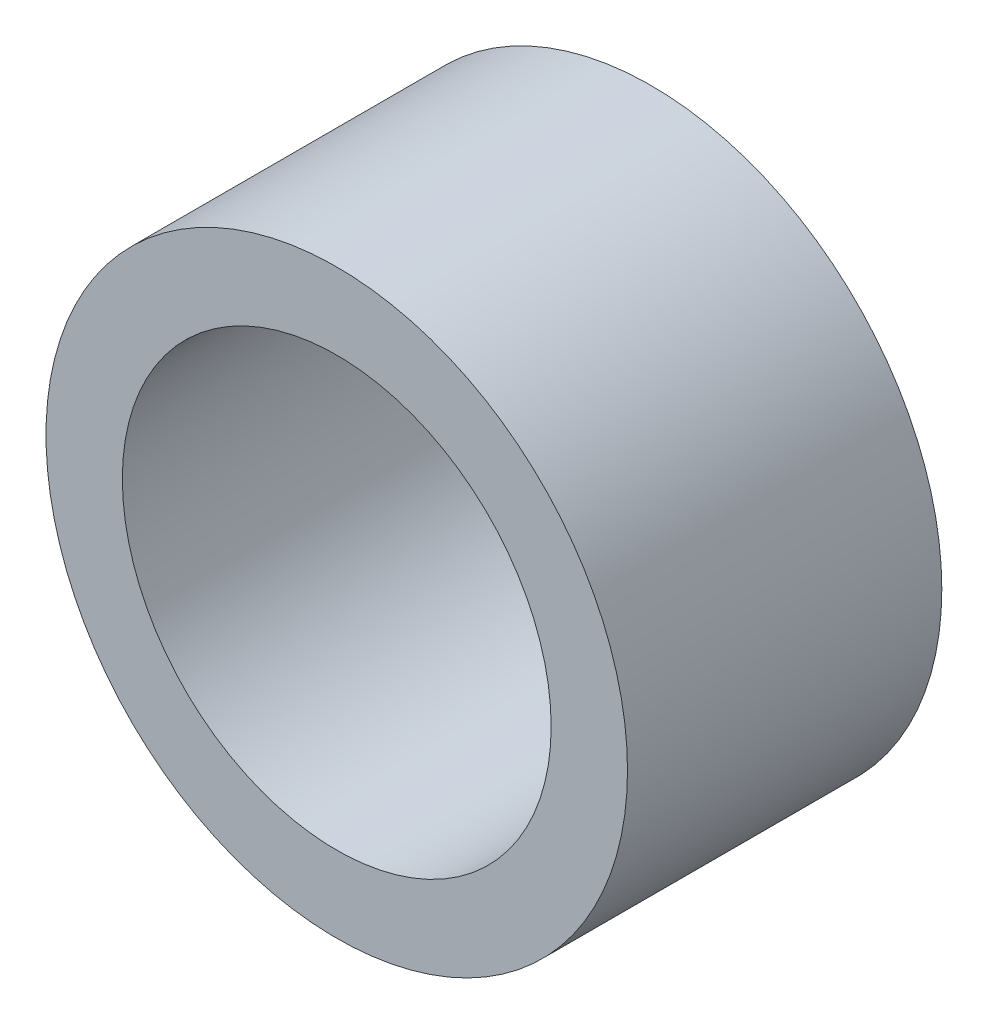
ISO-10303-21;
HEADER;
FILE_DESCRIPTION(('STEP AP214'),'2;1');
FILE_NAME('part.step','',(''),(''),'','','');
FILE_SCHEMA(('AUTOMOTIVE_DESIGN { 1 0 10303 214 1 1 1 1 }'));
ENDSEC;
DATA;
#1=APPLICATION_CONTEXT('core data for automotive mechanical design processes');
#2=APPLICATION_PROTOCOL_DEFINITION('international standard','automotive_design',2000,#1);
#3=PRODUCT_CONTEXT('',#1,'mechanical');
#4=PRODUCT('Part','Part','',(#3));
#5=PRODUCT_RELATED_PRODUCT_CATEGORY('part','',(#4));
#6=PRODUCT_DEFINITION_FORMATION('','',#4);
#7=PRODUCT_DEFINITION_CONTEXT('part definition',#1,'design');
#8=PRODUCT_DEFINITION('design','',#6,#7);
#9=PRODUCT_DEFINITION_SHAPE('','',#8);
#10=(LENGTH_UNIT() NAMED_UNIT(*) SI_UNIT(.MILLI.,.METRE.));
#11=(NAMED_UNIT(*) PLANE_ANGLE_UNIT() SI_UNIT($,.RADIAN.));
#12=(NAMED_UNIT(*) SI_UNIT($,.STERADIAN.) SOLID_ANGLE_UNIT());
#13=UNCERTAINTY_MEASURE_WITH_UNIT(LENGTH_MEASURE(1.E-05),#10,'distance_accuracy_value','');
#14=(GEOMETRIC_REPRESENTATION_CONTEXT(3) GLOBAL_UNCERTAINTY_ASSIGNED_CONTEXT((#13)) GLOBAL_UNIT_ASSIGNED_CONTEXT((#10,
#11,#12)) REPRESENTATION_CONTEXT('',''));
#15=CARTESIAN_POINT('',(0.,0.,0.));
#16=DIRECTION('',(0.,0.,1.));
#17=DIRECTION('',(1.,0.,0.));
#18=AXIS2_PLACEMENT_3D('',#15,#16,#17);
#19=CARTESIAN_POINT('',(0.,0.,7.112));
#20=DIRECTION('',(0.,0.,1.));
#21=DIRECTION('',(1.,0.,0.));
#22=AXIS2_PLACEMENT_3D('',#19,#20,#21);
#23=PLANE('',#22);
#24=CARTESIAN_POINT('',(0.,0.,7.112));
#25=DIRECTION('',(0.,0.,1.));
#26=DIRECTION('',(1.,0.,0.));
#27=AXIS2_PLACEMENT_3D('',#24,#25,#26);
#28=CIRCLE('',#27,6.5786);
#29=CARTESIAN_POINT('',(6.5786,0.,7.112));
#30=VERTEX_POINT('',#29);
#31=EDGE_CURVE('E10',#30,#30,#28,.T.);
#32=ORIENTED_EDGE('',*,*,#31,.T.);
#33=EDGE_LOOP('',(#32));
#34=FACE_BOUND('',#33,.T.);
#35=CARTESIAN_POINT('',(0.,0.,7.112));
#36=DIRECTION('',(0.,0.,1.));
#37=DIRECTION('',(1.,0.,0.));
#38=AXIS2_PLACEMENT_3D('',#35,#36,#37);
#39=CIRCLE('',#38,4.8514);
#40=CARTESIAN_POINT('',(4.8514,0.,7.112));
#41=VERTEX_POINT('',#40);
#42=EDGE_CURVE('E43',#41,#41,#39,.T.);
#43=ORIENTED_EDGE('',*,*,#42,.F.);
#44=EDGE_LOOP('',(#43));
#45=FACE_BOUND('',#44,.T.);
#46=ADVANCED_FACE('F32',(#34,#45),#23,.T.);
#47=CARTESIAN_POINT('',(0.,0.,0.));
#48=DIRECTION('',(0.,0.,1.));
#49=DIRECTION('',(1.,0.,0.));
#50=AXIS2_PLACEMENT_3D('',#47,#48,#49);
#51=PLANE('',#50);
#52=CARTESIAN_POINT('',(0.,0.,0.));
#53=DIRECTION('',(0.,0.,1.));
#54=DIRECTION('',(1.,0.,0.));
#55=AXIS2_PLACEMENT_3D('',#52,#53,#54);
#56=CIRCLE('',#55,6.5786);
#57=CARTESIAN_POINT('',(6.5786,0.,0.));
#58=VERTEX_POINT('',#57);
#59=EDGE_CURVE('E36',#58,#58,#56,.T.);
#60=ORIENTED_EDGE('',*,*,#59,.F.);
#61=EDGE_LOOP('',(#60));
#62=FACE_BOUND('',#61,.T.);
#63=CARTESIAN_POINT('',(0.,0.,0.));
#64=DIRECTION('',(0.,0.,1.));
#65=DIRECTION('',(1.,0.,0.));
#66=AXIS2_PLACEMENT_3D('',#63,#64,#65);
#67=CIRCLE('',#66,4.8514);
#68=CARTESIAN_POINT('',(4.8514,0.,0.));
#69=VERTEX_POINT('',#68);
#70=EDGE_CURVE('E45',#69,#69,#67,.T.);
#71=ORIENTED_EDGE('',*,*,#70,.T.);
#72=EDGE_LOOP('',(#71));
#73=FACE_BOUND('',#72,.T.);
#74=ADVANCED_FACE('F55',(#62,#73),#51,.F.);
#75=CARTESIAN_POINT('',(0.,0.,7.112));
#76=DIRECTION('',(0.,0.,-1.));
#77=DIRECTION('',(-1.,0.,0.));
#78=AXIS2_PLACEMENT_3D('',#75,#76,#77);
#79=CYLINDRICAL_SURFACE('',#78,6.5786);
#80=ORIENTED_EDGE('',*,*,#31,.F.);
#81=EDGE_LOOP('',(#80));
#82=FACE_BOUND('',#81,.T.);
#83=ORIENTED_EDGE('',*,*,#59,.T.);
#84=EDGE_LOOP('',(#83));
#85=FACE_BOUND('',#84,.T.);
#86=ADVANCED_FACE('F34',(#82,#85),#79,.T.);
#87=CARTESIAN_POINT('',(0.,0.,7.112));
#88=DIRECTION('',(0.,0.,-1.));
#89=DIRECTION('',(-1.,0.,0.));
#90=AXIS2_PLACEMENT_3D('',#87,#88,#89);
#91=CYLINDRICAL_SURFACE('',#90,4.8514);
#92=ORIENTED_EDGE('',*,*,#42,.T.);
#93=EDGE_LOOP('',(#92));
#94=FACE_BOUND('',#93,.T.);
#95=ORIENTED_EDGE('',*,*,#70,.F.);
#96=EDGE_LOOP('',(#95));
#97=FACE_BOUND('',#96,.T.);
#98=ADVANCED_FACE('F51',(#94,#97),#91,.F.);
#99=CLOSED_SHELL('',(#46,#74,#86,#98));
#100=MANIFOLD_SOLID_BREP('B2',#99);
#101=ADVANCED_BREP_SHAPE_REPRESENTATION('',(#18,#100),#14);
#102=SHAPE_DEFINITION_REPRESENTATION(#9,#101);
ENDSEC;
END-ISO-10303-21;
